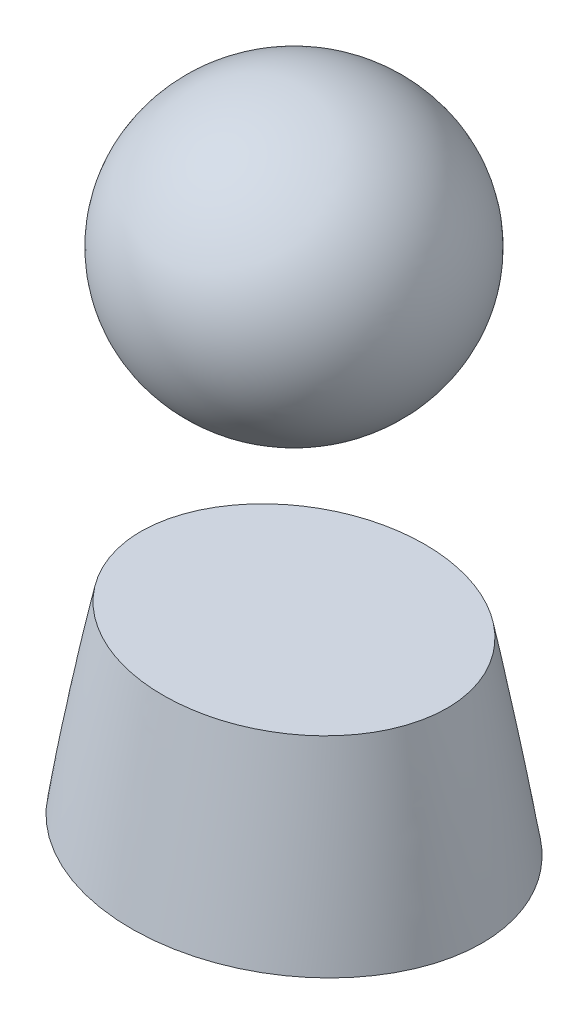
ISO-10303-21;
HEADER;
FILE_DESCRIPTION(('STEP AP214'),'2;1');
FILE_NAME('part.step','',(''),(''),'','','');
FILE_SCHEMA(('AUTOMOTIVE_DESIGN { 1 0 10303 214 1 1 1 1 }'));
ENDSEC;
DATA;
#1=APPLICATION_CONTEXT('core data for automotive mechanical design processes');
#2=APPLICATION_PROTOCOL_DEFINITION('international standard','automotive_design',2000,#1);
#3=PRODUCT_CONTEXT('',#1,'mechanical');
#4=PRODUCT('Part','Part','',(#3));
#5=PRODUCT_RELATED_PRODUCT_CATEGORY('part','',(#4));
#6=PRODUCT_DEFINITION_FORMATION('','',#4);
#7=PRODUCT_DEFINITION_CONTEXT('part definition',#1,'design');
#8=PRODUCT_DEFINITION('design','',#6,#7);
#9=PRODUCT_DEFINITION_SHAPE('','',#8);
#10=(LENGTH_UNIT() NAMED_UNIT(*) SI_UNIT(.MILLI.,.METRE.));
#11=(NAMED_UNIT(*) PLANE_ANGLE_UNIT() SI_UNIT($,.RADIAN.));
#12=(NAMED_UNIT(*) SI_UNIT($,.STERADIAN.) SOLID_ANGLE_UNIT());
#13=UNCERTAINTY_MEASURE_WITH_UNIT(LENGTH_MEASURE(1.E-05),#10,'distance_accuracy_value','');
#14=(GEOMETRIC_REPRESENTATION_CONTEXT(3) GLOBAL_UNCERTAINTY_ASSIGNED_CONTEXT((#13)) GLOBAL_UNIT_ASSIGNED_CONTEXT((#10,
#11,#12)) REPRESENTATION_CONTEXT('',''));
#15=CARTESIAN_POINT('',(0.,0.,0.));
#16=DIRECTION('',(0.,0.,1.));
#17=DIRECTION('',(1.,0.,0.));
#18=AXIS2_PLACEMENT_3D('',#15,#16,#17);
#19=CARTESIAN_POINT('',(-17.145,29.7605525885439,0.));
#20=DIRECTION('',(0.,1.,0.));
#21=DIRECTION('',(0.,0.,1.));
#22=AXIS2_PLACEMENT_3D('',#19,#20,#21);
#23=PLANE('',#22);
#24=CARTESIAN_POINT('',(-17.1450009335798,29.7605525885439,0.));
#25=CARTESIAN_POINT('',(-17.1450013778071,29.7605525885439,0.375152334039764));
#26=CARTESIAN_POINT('',(-17.1279041922706,29.7605525885439,0.750300722329052));
#27=CARTESIAN_POINT('',(-17.0603353167154,29.7605525885438,1.4977264524812));
#28=CARTESIAN_POINT('',(-17.0098485109687,29.7605525885439,1.8700024167198));
#29=CARTESIAN_POINT('',(-16.8764855934133,29.7605525885439,2.60929300532626));
#30=CARTESIAN_POINT('',(-16.7935585157081,29.7605525885439,2.97629840403801));
#31=CARTESIAN_POINT('',(-16.5966214415578,29.7605525885439,3.7017993123013));
#32=CARTESIAN_POINT('',(-16.482615844592,29.7605525885439,4.06029601854201));
#33=CARTESIAN_POINT('',(-16.2300444775407,29.7605525885439,4.7525239738148));
#34=CARTESIAN_POINT('',(-16.0926242687534,29.7605525885439,5.08667437085326));
#35=CARTESIAN_POINT('',(-15.7917188183559,29.7605525885439,5.74299843424312));
#36=CARTESIAN_POINT('',(-15.6282343116365,29.7605525885439,6.06517243795679));
#37=CARTESIAN_POINT('',(-15.2771323911803,29.7605525885439,6.69589979657489));
#38=CARTESIAN_POINT('',(-15.0895240046777,29.7605525885439,7.00445818876534));
#39=CARTESIAN_POINT('',(-14.6920653643805,29.7605525885439,7.60690943938902));
#40=CARTESIAN_POINT('',(-14.4822130172333,29.7605525885439,7.9008009137014));
#41=CARTESIAN_POINT('',(-14.0205542279075,29.7605525885439,8.5008053288898));
#42=CARTESIAN_POINT('',(-13.7666519350543,29.7605525885439,8.80530524433644));
#43=CARTESIAN_POINT('',(-13.2364217557339,29.7605525885439,9.39412630618957));
#44=CARTESIAN_POINT('',(-12.9600937663156,29.7605525885439,9.67844735994846));
#45=CARTESIAN_POINT('',(-12.5303491848176,29.7605525885439,10.0889643911015));
#46=CARTESIAN_POINT('',(-12.3845117028983,29.7605525885439,10.2231814537305));
#47=CARTESIAN_POINT('',(-12.0879888332437,29.7605525885439,10.4861500591995));
#48=CARTESIAN_POINT('',(-11.9373034683631,29.7605525885439,10.6149016277993));
#49=CARTESIAN_POINT('',(-11.4783988407301,29.7605525885439,10.9928440781801));
#50=CARTESIAN_POINT('',(-11.1633033381443,29.7605525885438,11.233749107272));
#51=CARTESIAN_POINT('',(-10.4750204974985,29.7605525885438,11.7229578669949));
#52=CARTESIAN_POINT('',(-10.0996141716325,29.7605525885439,11.9681340232837));
#53=CARTESIAN_POINT('',(-9.33125262214956,29.7605525885439,12.4292435392339));
#54=CARTESIAN_POINT('',(-8.93829593684518,29.7605525885439,12.6451744571343));
#55=CARTESIAN_POINT('',(-8.13725671460576,29.7605525885439,13.0473712643254));
#56=CARTESIAN_POINT('',(-7.72916820282187,29.7605525885439,13.2336252784755));
#57=CARTESIAN_POINT('',(-7.1077228651408,29.7605525885439,13.4902084210085));
#58=CARTESIAN_POINT('',(-6.89900561177536,29.7605525885439,13.5719419973766));
#59=CARTESIAN_POINT('',(-6.47872279030679,29.7605525885439,13.727728867033));
#60=CARTESIAN_POINT('',(-6.26715717968635,29.7605525885438,13.8017820455324));
#61=CARTESIAN_POINT('',(-5.57608128975507,29.7605525885438,14.0297748934058));
#62=CARTESIAN_POINT('',(-5.09135781295021,29.7605525885438,14.1682089663145));
#63=CARTESIAN_POINT('',(-4.11256752687502,29.7605525885439,14.4065693279633));
#64=CARTESIAN_POINT('',(-3.61849936337521,29.7605525885439,14.5064899897924));
#65=CARTESIAN_POINT('',(-2.62386910546117,29.7605525885439,14.667835915586));
#66=CARTESIAN_POINT('',(-2.12330463868679,29.7605525885439,14.7292466880579));
#67=CARTESIAN_POINT('',(-1.1191359099656,29.7605525885439,14.8132592189933));
#68=CARTESIAN_POINT('',(-0.615531825997053,29.7605525885439,14.8358632280006));
#69=CARTESIAN_POINT('',(0.97384239784154,29.7605525885439,14.844953174454));
#70=CARTESIAN_POINT('',(2.0612639311954,29.7605525885439,14.7597312498829));
#71=CARTESIAN_POINT('',(3.66888325386241,29.7605525885439,14.4979956145497));
#72=CARTESIAN_POINT('',(4.20115250299303,29.7605525885439,14.3883262976066));
#73=CARTESIAN_POINT('',(5.25465924206403,29.7605525885439,14.124209398421));
#74=CARTESIAN_POINT('',(5.77589801274377,29.7605525885438,13.9697670456862));
#75=CARTESIAN_POINT('',(6.80382962633154,29.7605525885438,13.6153238715974));
#76=CARTESIAN_POINT('',(7.31049029099118,29.7605525885439,13.4152298505924));
#77=CARTESIAN_POINT('',(8.30403091475486,29.7605525885439,12.9705764820614));
#78=CARTESIAN_POINT('',(8.79090820102972,29.7605525885439,12.7260111505253));
#79=CARTESIAN_POINT('',(9.74026369414392,29.7605525885439,12.1934781305938));
#80=CARTESIAN_POINT('',(10.2027455221579,29.7605525885439,11.905516908343));
#81=CARTESIAN_POINT('',(11.0983140153724,29.7605525885439,11.2870570889229));
#82=CARTESIAN_POINT('',(11.5314071600739,29.7605525885439,10.9565679149937));
#83=CARTESIAN_POINT('',(12.3286385749194,29.7605525885439,10.2824307936652));
#84=CARTESIAN_POINT('',(12.6955204468528,29.7605525885439,9.94202846144049));
#85=CARTESIAN_POINT('',(13.3955202871928,29.7605525885439,9.22797476001959));
#86=CARTESIAN_POINT('',(13.7286352060745,29.7605525885439,8.85432039351379));
#87=CARTESIAN_POINT('',(14.3564747928057,29.7605525885439,8.07651875331569));
#88=CARTESIAN_POINT('',(14.6512307767733,29.7605525885439,7.67239678445217));
#89=CARTESIAN_POINT('',(15.1979253421278,29.7605525885439,6.83608526097047));
#90=CARTESIAN_POINT('',(15.4498769853065,29.7605525885439,6.40390432441768));
#91=CARTESIAN_POINT('',(15.7758800953011,29.7605525885439,5.76821705926298));
#92=CARTESIAN_POINT('',(15.8695517179097,29.7605525885439,5.57459782175926));
#93=CARTESIAN_POINT('',(16.0476367654036,29.7605525885439,5.18315084618742));
#94=CARTESIAN_POINT('',(16.1320504384026,29.7605525885439,4.98532322107407));
#95=CARTESIAN_POINT('',(16.3709787051575,29.7605525885439,4.38613895166284));
#96=CARTESIAN_POINT('',(16.5112331253054,29.7605525885439,3.97897860234383));
#97=CARTESIAN_POINT('',(16.7512340412033,29.7605525885439,3.15348382322147));
#98=CARTESIAN_POINT('',(16.8510306659597,29.7605525885439,2.7351639101703));
#99=CARTESIAN_POINT('',(17.0084279699224,29.7605525885439,1.89066918213623));
#100=CARTESIAN_POINT('',(17.066037106862,29.7605525885439,1.46449595915525));
#101=CARTESIAN_POINT('',(17.132649653631,29.7605525885439,0.665619153937831));
#102=CARTESIAN_POINT('',(17.1471103337068,29.7605525885439,0.293363910471236));
#103=CARTESIAN_POINT('',(17.1423896477778,29.7605525885439,-0.45090905090994));
#104=CARTESIAN_POINT('',(17.1232118326451,29.7605525885439,-0.822926789748666));
#105=CARTESIAN_POINT('',(17.0521066540984,29.7605525885439,-1.56374945569226));
#106=CARTESIAN_POINT('',(17.0001825574533,29.7605525885439,-1.93255469955535));
#107=CARTESIAN_POINT('',(16.8646584912801,29.7605525885439,-2.66430932091683));
#108=CARTESIAN_POINT('',(16.781056588466,29.7605525885438,-3.02725833960199));
#109=CARTESIAN_POINT('',(16.5878058160912,29.7605525885438,-3.72891785497544));
#110=CARTESIAN_POINT('',(16.4794687663447,29.7605525885439,-4.06799127353928));
#111=CARTESIAN_POINT('',(16.2362291434658,29.7605525885439,-4.73647389703828));
#112=CARTESIAN_POINT('',(16.1013258966547,29.7605525885439,-5.06588285665388));
#113=CARTESIAN_POINT('',(15.8061746683433,29.7605525885439,-5.71313757420066));
#114=CARTESIAN_POINT('',(15.6459259287445,29.7605525885439,-6.03098298590949));
#115=CARTESIAN_POINT('',(15.3018427532958,29.7605525885439,-6.65364320958553));
#116=CARTESIAN_POINT('',(15.1180060312871,29.7605525885439,-6.95845675467507));
#117=CARTESIAN_POINT('',(14.7126660648001,29.7605525885439,-7.57829126593854));
#118=CARTESIAN_POINT('',(14.4893104834817,29.7605525885439,-7.89210073125778));
#119=CARTESIAN_POINT('',(14.0193746417614,29.7605525885439,-8.50179640951397));
#120=CARTESIAN_POINT('',(13.7727935097734,29.7605525885439,-8.79768194913379));
#121=CARTESIAN_POINT('',(13.2583695753719,29.7605525885439,-9.37051385275651));
#122=CARTESIAN_POINT('',(12.9905196796811,29.7605525885439,-9.64745384048063));
#123=CARTESIAN_POINT('',(12.4355108582494,29.7605525885439,-10.1812321099176));
#124=CARTESIAN_POINT('',(12.148351684513,29.7605525885439,-10.4380701333623));
#125=CARTESIAN_POINT('',(11.5183173820492,29.7605525885439,-10.9627204639952));
#126=CARTESIAN_POINT('',(11.1730411442717,29.7605525885439,-11.2276515423878));
#127=CARTESIAN_POINT('',(10.4632839292587,29.7605525885439,-11.7304235874309));
#128=CARTESIAN_POINT('',(10.0988003918368,29.7605525885439,-11.9682609292667));
#129=CARTESIAN_POINT('',(9.35314918664964,29.7605525885439,-12.416454516691));
#130=CARTESIAN_POINT('',(8.97197509318294,29.7605525885439,-12.6268000517825));
#131=CARTESIAN_POINT('',(8.1954399963707,29.7605525885439,-13.0194585395137));
#132=CARTESIAN_POINT('',(7.80007924009002,29.7605525885439,-13.2017719800484));
#133=CARTESIAN_POINT('',(7.17231606942414,29.7605525885439,-13.4646124547136));
#134=CARTESIAN_POINT('',(6.94394418193654,29.7605525885439,-13.5548852470208));
#135=CARTESIAN_POINT('',(6.48376770167296,29.7605525885439,-13.7262162355324));
#136=CARTESIAN_POINT('',(6.25196304761388,29.7605525885439,-13.8072742670068));
#137=CARTESIAN_POINT('',(5.55199528674742,29.7605525885439,-14.0366415217387));
#138=CARTESIAN_POINT('',(5.0792397357354,29.7605525885439,-14.17116003816));
#139=CARTESIAN_POINT('',(4.12472727731103,29.7605525885439,-14.4036081078253));
#140=CARTESIAN_POINT('',(3.64296738831916,29.7605525885439,-14.5015253076534));
#141=CARTESIAN_POINT('',(2.67343267209394,29.7605525885439,-14.6607180136099));
#142=CARTESIAN_POINT('',(2.18565781071901,29.7605525885439,-14.7219933116575));
#143=CARTESIAN_POINT('',(1.16308765592509,29.7605525885439,-14.8114997566861));
#144=CARTESIAN_POINT('',(0.627987007717201,29.7605525885439,-14.8362872417715));
#145=CARTESIAN_POINT('',(-0.442451928092871,29.7605525885439,-14.8414025151709));
#146=CARTESIAN_POINT('',(-0.977790229271674,29.7605525885439,-14.8217273093246));
#147=CARTESIAN_POINT('',(-2.04518101429725,29.7605525885439,-14.7385132633092));
#148=CARTESIAN_POINT('',(-2.57723263162479,29.7605525885439,-14.6749633152985));
#149=CARTESIAN_POINT('',(-3.63430336916061,29.7605525885439,-14.5043515863934));
#150=CARTESIAN_POINT('',(-4.15932242990948,29.7605525885439,-14.3972894378483));
#151=CARTESIAN_POINT('',(-5.21092165766405,29.7605525885439,-14.1365956137016));
#152=CARTESIAN_POINT('',(-5.73724804028652,29.7605525885439,-13.9819277299258));
#153=CARTESIAN_POINT('',(-6.51481523310871,29.7605525885439,-13.715505425036));
#154=CARTESIAN_POINT('',(-6.7720508555581,29.7605525885439,-13.6209462868462));
#155=CARTESIAN_POINT('',(-7.28203318259827,29.7605525885439,-13.4204150099106));
#156=CARTESIAN_POINT('',(-7.53477986511734,29.7605525885439,-13.3144428150658));
#157=CARTESIAN_POINT('',(-8.28546567697343,29.7605525885439,-12.9796488840768));
#158=CARTESIAN_POINT('',(-8.77599214159809,29.7605525885439,-12.73390135084));
#159=CARTESIAN_POINT('',(-9.73231452127438,29.7605525885439,-12.1984026327232));
#160=CARTESIAN_POINT('',(-10.1981118644749,29.7605525885439,-11.9086539927212));
#161=CARTESIAN_POINT('',(-11.0728933144021,29.7605525885439,-11.3046709199446));
#162=CARTESIAN_POINT('',(-11.4836095097904,29.7605525885439,-10.9929605949623));
#163=CARTESIAN_POINT('',(-12.0761596881795,29.7605525885439,-10.4974516923091));
#164=CARTESIAN_POINT('',(-12.2697788636796,29.7605525885439,-10.3276014354401));
#165=CARTESIAN_POINT('',(-12.6486236065961,29.7605525885439,-9.97878699755769));
#166=CARTESIAN_POINT('',(-12.8338491090979,29.7605525885439,-9.79982274608159));
#167=CARTESIAN_POINT('',(-13.375960472181,29.7605525885439,-9.24986626583086));
#168=CARTESIAN_POINT('',(-13.719559096376,29.7605525885439,-8.86557843115543));
#169=CARTESIAN_POINT('',(-14.366232300721,29.7605525885439,-8.06441655278572));
#170=CARTESIAN_POINT('',(-14.6693135700056,29.7605525885439,-7.64754790601001));
#171=CARTESIAN_POINT('',(-15.1939186242464,29.7605525885439,-6.83951807754708));
#172=CARTESIAN_POINT('',(-15.4209174994887,29.7605525885439,-6.45192610608855));
#173=CARTESIAN_POINT('',(-15.7325566869534,29.7605525885439,-5.85556663885954));
#174=CARTESIAN_POINT('',(-15.8316385761918,29.7605525885439,-5.6542552610159));
#175=CARTESIAN_POINT('',(-16.0197660418504,29.7605525885439,-5.24699750119169));
#176=CARTESIAN_POINT('',(-16.1088115454711,29.7605525885439,-5.04105108560367));
#177=CARTESIAN_POINT('',(-16.3599346150016,29.7605525885439,-4.41813471745316));
#178=CARTESIAN_POINT('',(-16.50665030308,29.7605525885439,-3.9948432627804));
#179=CARTESIAN_POINT('',(-16.7563372381106,29.7605525885439,-3.13582915545711));
#180=CARTESIAN_POINT('',(-16.8593339951368,29.7605525885438,-2.70011391095506));
#181=CARTESIAN_POINT('',(-17.0072947953413,29.7605525885438,-1.88758400331086));
#182=CARTESIAN_POINT('',(-17.0587201627951,29.7605525885438,-1.51193864491978));
#183=CARTESIAN_POINT('',(-17.1275718315784,29.7605525885439,-0.757527371864787));
#184=CARTESIAN_POINT('',(-17.1450004850786,29.7605525885439,-0.37876167491247));
#185=CARTESIAN_POINT('',(-17.1450009335798,29.7605525885439,0.));
#186=B_SPLINE_CURVE_WITH_KNOTS('',3,(#24,#25,#26,#27,#28,#29,#30,#31,#32,#33,#34,#35,#36,#37,
#38,#39,#40,#41,#42,#43,#44,#45,#46,#47,#48,#49,#50,#51,#52,#53,#54,#55,#56,#57,#58,#59,#60,#61,
#62,#63,#64,#65,#66,#67,#68,#69,#70,#71,#72,#73,#74,#75,#76,#77,#78,#79,#80,#81,#82,#83,#84,#85,
#86,#87,#88,#89,#90,#91,#92,#93,#94,#95,#96,#97,#98,#99,#100,#101,#102,#103,#104,#105,#106,#107,
#108,#109,#110,#111,#112,#113,#114,#115,#116,#117,#118,#119,#120,#121,#122,#123,#124,#125,#126,
#127,#128,#129,#130,#131,#132,#133,#134,#135,#136,#137,#138,#139,#140,#141,#142,#143,#144,#145,
#146,#147,#148,#149,#150,#151,#152,#153,#154,#155,#156,#157,#158,#159,#160,#161,#162,#163,#164,
#165,#166,#167,#168,#169,#170,#171,#172,#173,#174,#175,#176,#177,#178,#179,#180,#181,#182,#183,
#184,#185),.UNSPECIFIED.,.T.,.F.,(4,2,2,2,2,2,2,2,2,2,2,2,2,2,2,2,2,2,2,2,2,2,2,2,2,2,2,2,2,2,2,
2,2,2,2,2,2,2,2,2,2,2,2,2,2,2,2,2,2,2,2,2,2,2,2,2,2,2,2,2,2,2,2,2,2,2,2,2,2,2,2,2,2,2,2,2,2,2,2,
2,4),(0.,1.12507973806666,2.25066915701659,3.37803410257492,4.50523954099959,5.58800241600622,
6.67073476758579,7.75306312989832,8.83549343942205,10.0237198817715,11.211951779295,
11.8064334121582,12.400912242816,13.5897553684035,14.9335373332019,16.2774314247801,
17.621861929083,18.2941825077125,18.9665131331982,20.4770519907603,21.9878114584536,
23.4991390929912,25.0103790772352,28.2643142778856,29.8932545820433,31.5220047019539,
33.1541102137915,34.786435502658,36.4185178091993,38.0502391036126,39.5495119481477,
41.0489200729906,42.5470963019713,44.0448145364559,44.6898782107758,45.3349245931255,
46.6246736695412,47.9128197691052,49.2007075508191,50.3168510402486,51.4328767169106,
52.5487910764638,53.6647735508676,54.7315225406827,55.7982985851283,56.8651065435026,
57.932017975639,59.0863877946635,60.2408009510472,61.3956007422895,62.5504153678545,
63.8546778375873,65.1591145974642,66.4640580458594,67.7689787793043,68.505501058743,
69.2420365027553,70.7149821163074,72.1884244200594,73.6618750910717,75.2670449031932,
76.8723228122175,78.4780072812355,80.0837053175612,81.7271739588278,82.5491282743701,
83.3710866302681,85.0145560636816,86.6579304804542,88.2023736907398,88.9747918554214,
89.7472159927738,91.2909830132629,92.8344948529383,94.1798706570363,94.8527496019644,
95.5256334273349,96.8672057597826,98.2079942026895,99.3439769330798,100.479881064107),.UNSPECIFIED.);
#187=CARTESIAN_POINT('',(-17.1450009335798,29.7605525885439,0.));
#188=VERTEX_POINT('',#187);
#189=EDGE_CURVE('E13',#188,#188,#186,.T.);
#190=ORIENTED_EDGE('',*,*,#189,.F.);
#191=EDGE_LOOP('',(#190));
#192=FACE_BOUND('',#191,.T.);
#193=ADVANCED_FACE('F109',(#192),#23,.F.);
#194=CARTESIAN_POINT('',(-8.73125,65.0875,0.));
#195=CARTESIAN_POINT('',(-15.328017064921,45.6489549322543,0.));
#196=CARTESIAN_POINT('',(-18.8107246222282,25.2885107510739,0.));
#197=CARTESIAN_POINT('',(-19.05,4.7625,0.));
#198=CARTESIAN_POINT('',(-8.73125,65.0875,-1.14291794324027));
#199=CARTESIAN_POINT('',(-15.328017064921,45.6489549322543,-1.5931583451228));
#200=CARTESIAN_POINT('',(-18.8107246222282,25.2885107510739,-2.04339874700533));
#201=CARTESIAN_POINT('',(-19.05,4.7625,-2.49363914888786));
#202=CARTESIAN_POINT('',(-8.27717435647707,65.0875,-3.42830634321734));
#203=CARTESIAN_POINT('',(-14.4977313337537,45.6489549322543,-4.77885058683869));
#204=CARTESIAN_POINT('',(-17.7988575226424,25.2885107510739,-6.12939483046004));
#205=CARTESIAN_POINT('',(-18.0592660432166,4.7625,-7.4799390740814));
#206=CARTESIAN_POINT('',(-6.33470776698936,65.0875,-6.33493628157651));
#207=CARTESIAN_POINT('',(-11.0501306583208,45.6489549322543,-8.83050790150456));
#208=CARTESIAN_POINT('',(-13.5759804583612,25.2885107510739,-11.3260795214326));
#209=CARTESIAN_POINT('',(-13.8212920071658,4.76249999999999,-13.8216511413607));
#210=CARTESIAN_POINT('',(-3.42845769947884,65.0875,-8.27689774044255));
#211=CARTESIAN_POINT('',(-5.96301617037461,45.6489549322543,-11.5374769860811));
#212=CARTESIAN_POINT('',(-7.32980232591518,25.2885107510739,-14.7980562317196));
#213=CARTESIAN_POINT('',(-7.48030141413001,4.7625,-18.0586354773582));
#214=CARTESIAN_POINT('',(0.,65.0874999999999,-8.95888023906617));
#215=CARTESIAN_POINT('',(0.,45.6489549322542,-12.4881496493303));
#216=CARTESIAN_POINT('',(0.,25.2885107510739,-16.0174190595945));
#217=CARTESIAN_POINT('',(0.,4.76249999999999,-19.5466884698586));
#218=CARTESIAN_POINT('',(3.42845769947884,65.0875000000001,-8.27689774044256));
#219=CARTESIAN_POINT('',(5.96301617037462,45.6489549322544,-11.5374769860811));
#220=CARTESIAN_POINT('',(7.32980232591521,25.2885107510739,-14.7980562317196));
#221=CARTESIAN_POINT('',(7.48030141413002,4.7625,-18.0586354773582));
#222=CARTESIAN_POINT('',(6.33470776698938,65.0874999999999,-6.33493628157649));
#223=CARTESIAN_POINT('',(11.0501306583208,45.6489549322542,-8.83050790150453));
#224=CARTESIAN_POINT('',(13.5759804583612,25.2885107510738,-11.3260795214326));
#225=CARTESIAN_POINT('',(13.8212920071658,4.76249999999999,-13.8216511413606));
#226=CARTESIAN_POINT('',(8.27717435647706,65.0875,-3.42830634321734));
#227=CARTESIAN_POINT('',(14.4977313337537,45.6489549322543,-4.77885058683869));
#228=CARTESIAN_POINT('',(17.7988575226424,25.2885107510739,-6.12939483046005));
#229=CARTESIAN_POINT('',(18.0592660432167,4.7625,-7.4799390740814));
#230=CARTESIAN_POINT('',(8.73125,65.0875,-1.14291794324027));
#231=CARTESIAN_POINT('',(15.328017064921,45.6489549322543,-1.5931583451228));
#232=CARTESIAN_POINT('',(18.8107246222282,25.2885107510739,-2.04339874700533));
#233=CARTESIAN_POINT('',(19.05,4.7625,-2.49363914888786));
#234=CARTESIAN_POINT('',(8.73125,65.0875,1.14291794324027));
#235=CARTESIAN_POINT('',(15.328017064921,45.6489549322543,1.5931583451228));
#236=CARTESIAN_POINT('',(18.8107246222282,25.2885107510739,2.04339874700533));
#237=CARTESIAN_POINT('',(19.05,4.7625,2.49363914888786));
#238=CARTESIAN_POINT('',(8.27717435647707,65.0875,3.42830634321734));
#239=CARTESIAN_POINT('',(14.4977313337537,45.6489549322543,4.77885058683869));
#240=CARTESIAN_POINT('',(17.7988575226424,25.2885107510739,6.12939483046005));
#241=CARTESIAN_POINT('',(18.0592660432167,4.7625,7.47993907408141));
#242=CARTESIAN_POINT('',(6.33470776698937,65.0875,6.33493628157652));
#243=CARTESIAN_POINT('',(11.0501306583208,45.6489549322543,8.83050790150456));
#244=CARTESIAN_POINT('',(13.5759804583612,25.2885107510739,11.3260795214326));
#245=CARTESIAN_POINT('',(13.8212920071658,4.76249999999999,13.8216511413606));
#246=CARTESIAN_POINT('',(3.42845769947884,65.0874999999998,8.27689774044254));
#247=CARTESIAN_POINT('',(5.96301617037461,45.6489549322542,11.5374769860811));
#248=CARTESIAN_POINT('',(7.32980232591521,25.2885107510738,14.7980562317196));
#249=CARTESIAN_POINT('',(7.48030141413002,4.76249999999999,18.0586354773582));
#250=CARTESIAN_POINT('',(0.,65.0875000000001,8.95888023906618));
#251=CARTESIAN_POINT('',(0.,45.6489549322544,12.4881496493303));
#252=CARTESIAN_POINT('',(0.,25.2885107510739,16.0174190595945));
#253=CARTESIAN_POINT('',(0.,4.7625,19.5466884698586));
#254=CARTESIAN_POINT('',(-3.42845769947884,65.0874999999999,8.27689774044255));
#255=CARTESIAN_POINT('',(-5.96301617037461,45.6489549322542,11.5374769860811));
#256=CARTESIAN_POINT('',(-7.32980232591519,25.2885107510738,14.7980562317196));
#257=CARTESIAN_POINT('',(-7.48030141413002,4.76249999999999,18.0586354773581));
#258=CARTESIAN_POINT('',(-6.3347077669894,65.0875000000001,6.33493628157649));
#259=CARTESIAN_POINT('',(-11.0501306583208,45.6489549322544,8.83050790150455));
#260=CARTESIAN_POINT('',(-13.5759804583612,25.2885107510739,11.3260795214326));
#261=CARTESIAN_POINT('',(-13.8212920071658,4.7625,13.8216511413607));
#262=CARTESIAN_POINT('',(-8.27717435647704,65.0874999999999,3.42830634321734));
#263=CARTESIAN_POINT('',(-14.4977313337537,45.6489549322542,4.77885058683869));
#264=CARTESIAN_POINT('',(-17.7988575226424,25.2885107510738,6.12939483046005));
#265=CARTESIAN_POINT('',(-18.0592660432167,4.7625,7.4799390740814));
#266=CARTESIAN_POINT('',(-8.73125,65.0875,1.14291794324027));
#267=CARTESIAN_POINT('',(-15.328017064921,45.6489549322543,1.5931583451228));
#268=CARTESIAN_POINT('',(-18.8107246222282,25.2885107510739,2.04339874700533));
#269=CARTESIAN_POINT('',(-19.05,4.7625,2.49363914888786));
#270=CARTESIAN_POINT('',(-8.73125,65.0875,0.));
#271=CARTESIAN_POINT('',(-15.328017064921,45.6489549322543,0.));
#272=CARTESIAN_POINT('',(-18.8107246222282,25.2885107510739,0.));
#273=CARTESIAN_POINT('',(-19.05,4.7625,0.));
#274=B_SPLINE_SURFACE_WITH_KNOTS('',3,3,((#194,#195,#196,#197),(#198,#199,#200,#201),(#202,#203,
#204,#205),(#206,#207,#208,#209),(#210,#211,#212,#213),(#214,#215,#216,#217),(#218,#219,#220,
#221),(#222,#223,#224,#225),(#226,#227,#228,#229),(#230,#231,#232,#233),(#234,#235,#236,#237),
(#238,#239,#240,#241),(#242,#243,#244,#245),(#246,#247,#248,#249),(#250,#251,#252,#253),(#254,
#255,#256,#257),(#258,#259,#260,#261),(#262,#263,#264,#265),(#266,#267,#268,#269),(#270,#271,
#272,#273)),.UNSPECIFIED.,.T.,.F.,.F.,(4,1,1,1,1,1,1,1,2,1,1,1,1,1,1,1,4),(4,4),(0.,0.0625,
0.125,0.1875,0.25,0.3125,0.375,0.4375,0.5,0.5625,0.625,0.6875,0.75,0.8125,0.875,0.9375,1.),(0.,
1.),.UNSPECIFIED.);
#275=CARTESIAN_POINT('',(-13.9700004681955,46.7432831100692,0.));
#276=CARTESIAN_POINT('',(-13.9700001911678,46.7432831100692,-0.290817565123765));
#277=CARTESIAN_POINT('',(-13.9570290086175,46.7432831100691,-0.581639347368171));
#278=CARTESIAN_POINT('',(-13.9057701381438,46.743283110069,-1.161050952386));
#279=CARTESIAN_POINT('',(-13.8674797983195,46.743283110069,-1.44964053815799));
#280=CARTESIAN_POINT('',(-13.7664014339072,46.7432831100691,-2.02258637108888));
#281=CARTESIAN_POINT('',(-13.7036050646597,46.7432831100691,-2.3069411419543));
#282=CARTESIAN_POINT('',(-13.5545021022606,46.743283110069,-2.86941367290619));
#283=CARTESIAN_POINT('',(-13.4681939355075,46.743283110069,-3.14753101418399));
#284=CARTESIAN_POINT('',(-13.2735062082406,46.743283110069,-3.69477723745416));
#285=CARTESIAN_POINT('',(-13.1652105045478,46.743283110069,-3.9639358772733));
#286=CARTESIAN_POINT('',(-12.9869638601126,46.743283110069,-4.36047926310636));
#287=CARTESIAN_POINT('',(-12.92490984978,46.743283110069,-4.49146969818798));
#288=CARTESIAN_POINT('',(-12.7956747026588,46.743283110069,-4.75090867386899));
#289=CARTESIAN_POINT('',(-12.7284931939968,46.743283110069,-4.87935702925083));
#290=CARTESIAN_POINT('',(-12.5195915509915,46.743283110069,-5.26064214275139));
#291=CARTESIAN_POINT('',(-12.3704880349012,46.743283110069,-5.50947712733046));
#292=CARTESIAN_POINT('',(-12.0542599790541,46.7432831100691,-5.99538073676888));
#293=CARTESIAN_POINT('',(-11.8871338069959,46.7432831100691,-6.23244829301498));
#294=CARTESIAN_POINT('',(-11.5206098118922,46.7432831100691,-6.71474000775222));
#295=CARTESIAN_POINT('',(-11.3196618614253,46.7432831100691,-6.95878725444479));
#296=CARTESIAN_POINT('',(-10.8999704178435,46.743283110069,-7.43103119633703));
#297=CARTESIAN_POINT('',(-10.6812268158625,46.743283110069,-7.65922779455349));
#298=CARTESIAN_POINT('',(-10.2275192914525,46.743283110069,-8.09903887993886));
#299=CARTESIAN_POINT('',(-9.99254960133414,46.743283110069,-8.31064741308884));
#300=CARTESIAN_POINT('',(-9.50806378402802,46.743283110069,-8.71648797386099));
#301=CARTESIAN_POINT('',(-9.25854676036834,46.7432831100691,-8.91071892872556));
#302=CARTESIAN_POINT('',(-8.71032162277379,46.7432831100691,-9.30802362862449));
#303=CARTESIAN_POINT('',(-8.40966913060625,46.7432831100691,-9.50841634707489));
#304=CARTESIAN_POINT('',(-7.79410118528702,46.743283110069,-9.8859520214061));
#305=CARTESIAN_POINT('',(-7.47918424965968,46.743283110069,-10.0630925532412));
#306=CARTESIAN_POINT('',(-6.83707931679096,46.743283110069,-10.3938768809598));
#307=CARTESIAN_POINT('',(-6.50988601081298,46.743283110069,-10.5475103622791));
#308=CARTESIAN_POINT('',(-5.84529388141572,46.743283110069,-10.8307818722452));
#309=CARTESIAN_POINT('',(-5.50789518007261,46.743283110069,-10.9604201877884));
#310=CARTESIAN_POINT('',(-4.77833928245682,46.743283110069,-11.2112911614699));
#311=CARTESIAN_POINT('',(-4.38496566177611,46.743283110069,-11.3289944350394));
#312=CARTESIAN_POINT('',(-3.59019976081121,46.743283110069,-11.5333302182281));
#313=CARTESIAN_POINT('',(-3.18880621977705,46.7432831100691,-11.6199578014554));
#314=CARTESIAN_POINT('',(-2.38042901358235,46.743283110069,-11.7622105983538));
#315=CARTESIAN_POINT('',(-1.97344337056316,46.743283110069,-11.8178245377514));
#316=CARTESIAN_POINT('',(-1.15639790099236,46.7432831100691,-11.8978685208998));
#317=CARTESIAN_POINT('',(-0.74633824560746,46.7432831100691,-11.922300288148));
#318=CARTESIAN_POINT('',(-0.113016470703369,46.7432831100691,-11.9356179951637));
#319=CARTESIAN_POINT('',(0.110062210915413,46.7432831100691,-11.9356394442135));
#320=CARTESIAN_POINT('',(0.556027553394261,46.743283110069,-11.9263424720493));
#321=CARTESIAN_POINT('',(0.778914210339288,46.743283110069,-11.9170238647169));
#322=CARTESIAN_POINT('',(1.44674253891864,46.7432831100691,-11.875186702807));
#323=CARTESIAN_POINT('',(1.89088492800577,46.743283110069,-11.8287874685829));
#324=CARTESIAN_POINT('',(2.7740228777061,46.743283110069,-11.6992401381186));
#325=CARTESIAN_POINT('',(3.21301570877047,46.743283110069,-11.616073383183));
#326=CARTESIAN_POINT('',(3.86495194853398,46.743283110069,-11.4637893669926));
#327=CARTESIAN_POINT('',(4.08118445033734,46.743283110069,-11.4084349610578));
#328=CARTESIAN_POINT('',(4.51109089058107,46.7432831100691,-11.2885065895627));
#329=CARTESIAN_POINT('',(4.72476484632064,46.7432831100691,-11.2239326863767));
#330=CARTESIAN_POINT('',(5.15052125214876,46.7432831100691,-11.085039507716));
#331=CARTESIAN_POINT('',(5.36258325408878,46.7432831100691,-11.01065745269));
#332=CARTESIAN_POINT('',(5.78316189810742,46.743283110069,-10.8525077481503));
#333=CARTESIAN_POINT('',(5.99167851449229,46.743283110069,-10.7687400306513));
#334=CARTESIAN_POINT('',(6.6113410194489,46.743283110069,-10.5035065617124));
#335=CARTESIAN_POINT('',(7.01663486004699,46.743283110069,-10.308098997287));
#336=CARTESIAN_POINT('',(7.8070961663412,46.743283110069,-9.88115895368144));
#337=CARTESIAN_POINT('',(8.19228544293632,46.7432831100691,-9.64966675684896));
#338=CARTESIAN_POINT('',(8.93880083834937,46.743283110069,-9.15101685412034));
#339=CARTESIAN_POINT('',(9.30013579116549,46.743283110069,-8.88387246334455));
#340=CARTESIAN_POINT('',(9.91394835363443,46.743283110069,-8.38013925245385));
#341=CARTESIAN_POINT('',(10.1723189051166,46.743283110069,-8.1507022002378));
#342=CARTESIAN_POINT('',(10.6698578935435,46.7432831100691,-7.67186491520451));
#343=CARTESIAN_POINT('',(10.909028133788,46.7432831100691,-7.42246656156331));
#344=CARTESIAN_POINT('',(11.3659796478203,46.743283110069,-6.90483393395048));
#345=CARTESIAN_POINT('',(11.5837643255018,46.743283110069,-6.63660266926655));
#346=CARTESIAN_POINT('',(11.9956023997085,46.7432831100691,-6.08245890118284));
#347=CARTESIAN_POINT('',(12.1896557290785,46.7432831100691,-5.79654634775175));
#348=CARTESIAN_POINT('',(12.5527459729484,46.7432831100691,-5.20635565953905));
#349=CARTESIAN_POINT('',(12.7215928841755,46.7432831100691,-4.90196020376724));
#350=CARTESIAN_POINT('',(13.0297117853257,46.743283110069,-4.27850561914596));
#351=CARTESIAN_POINT('',(13.168983485052,46.743283110069,-3.95944634645005));
#352=CARTESIAN_POINT('',(13.4157951945904,46.7432831100691,-3.30960240013579));
#353=CARTESIAN_POINT('',(13.5233649430766,46.7432831100691,-2.9788290436106));
#354=CARTESIAN_POINT('',(13.7050719785238,46.743283110069,-2.30822529395654));
#355=CARTESIAN_POINT('',(13.7792128085727,46.743283110069,-1.96839586471458));
#356=CARTESIAN_POINT('',(13.885262728024,46.743283110069,-1.32610378681848));
#357=CARTESIAN_POINT('',(13.9213157539786,46.743283110069,-1.02432763984676));
#358=CARTESIAN_POINT('',(13.954610671364,46.743283110069,-0.570236963025791));
#359=CARTESIAN_POINT('',(13.9622447865944,46.743283110069,-0.418630860581491));
#360=CARTESIAN_POINT('',(13.9704904464352,46.743283110069,-0.115225922616556));
#361=CARTESIAN_POINT('',(13.9711018926624,46.743283110069,0.0365729155743927));
#362=CARTESIAN_POINT('',(13.9623745641172,46.743283110069,0.491590981046394));
#363=CARTESIAN_POINT('',(13.9424916117429,46.7432831100691,0.79466961550446));
#364=CARTESIAN_POINT('',(13.8753839317936,46.743283110069,1.39787350254658));
#365=CARTESIAN_POINT('',(13.8281456628125,46.743283110069,1.69799721750398));
#366=CARTESIAN_POINT('',(13.7118830954677,46.743283110069,2.27042562286972));
#367=CARTESIAN_POINT('',(13.6447712176245,46.743283110069,2.54312089396454));
#368=CARTESIAN_POINT('',(13.4889367321261,46.7432831100691,3.08226790365596));
#369=CARTESIAN_POINT('',(13.4002130994067,46.743283110069,3.34871934544501));
#370=CARTESIAN_POINT('',(13.2021556551037,46.743283110069,3.87385516607717));
#371=CARTESIAN_POINT('',(13.092820720217,46.743283110069,4.1325391207059));
#372=CARTESIAN_POINT('',(12.8545454008194,46.7432831100691,4.64072082072147));
#373=CARTESIAN_POINT('',(12.7256033676286,46.7432831100691,4.89021779141941));
#374=CARTESIAN_POINT('',(12.4398684748872,46.7432831100691,5.39607204750604));
#375=CARTESIAN_POINT('',(12.2817567318221,46.743283110069,5.65168374111362));
#376=CARTESIAN_POINT('',(11.9465126673257,46.743283110069,6.15012276655927));
#377=CARTESIAN_POINT('',(11.769378093112,46.743283110069,6.39294857914106));
#378=CARTESIAN_POINT('',(11.3977424879261,46.743283110069,6.86490913384069));
#379=CARTESIAN_POINT('',(11.2032413165506,46.743283110069,7.09404376524474));
#380=CARTESIAN_POINT('',(10.7983224217794,46.7432831100691,7.53796961006559));
#381=CARTESIAN_POINT('',(10.5878967805408,46.7432831100691,7.75275358689637));
#382=CARTESIAN_POINT('',(10.1233359884571,46.7432831100691,8.19500373194685));
#383=CARTESIAN_POINT('',(9.86712717272373,46.7432831100691,8.42029502012634));
#384=CARTESIAN_POINT('',(9.33811196466489,46.743283110069,8.85064791082936));
#385=CARTESIAN_POINT('',(9.06529844926272,46.743283110069,9.05570073116315));
#386=CARTESIAN_POINT('',(8.50517124674605,46.743283110069,9.44542554229558));
#387=CARTESIAN_POINT('',(8.21784580154761,46.7432831100691,9.63008060717766));
#388=CARTESIAN_POINT('',(7.63094310819855,46.743283110069,9.97849082214723));
#389=CARTESIAN_POINT('',(7.33136942985099,46.743283110069,10.1422520053172));
#390=CARTESIAN_POINT('',(6.67930862504611,46.743283110069,10.4699428891846));
#391=CARTESIAN_POINT('',(6.32524282912837,46.743283110069,10.6307495961907));
#392=CARTESIAN_POINT('',(5.78590821900805,46.743283110069,10.85097124235));
#393=CARTESIAN_POINT('',(5.6048387783052,46.743283110069,10.9208542699936));
#394=CARTESIAN_POINT('',(5.24013594971236,46.743283110069,11.0535998635746));
#395=CARTESIAN_POINT('',(5.05650247385677,46.743283110069,11.1164621879803));
#396=CARTESIAN_POINT('',(4.50197339124454,46.743283110069,11.2946229822955));
#397=CARTESIAN_POINT('',(4.12764704097523,46.743283110069,11.3994147084856));
#398=CARTESIAN_POINT('',(3.3722260342222,46.7432831100691,11.5811794134043));
#399=CARTESIAN_POINT('',(2.99112884891071,46.7432831100691,11.6581417588679));
#400=CARTESIAN_POINT('',(2.18145660498807,46.7432831100691,11.7912912886329));
#401=CARTESIAN_POINT('',(1.75233373491759,46.7432831100691,11.8441970728599));
#402=CARTESIAN_POINT('',(0.891414839719358,46.743283110069,11.9154030204117));
#403=CARTESIAN_POINT('',(0.459619038832971,46.743283110069,11.9337060482418));
#404=CARTESIAN_POINT('',(-0.836346616006395,46.7432831100691,11.9359193764018));
#405=CARTESIAN_POINT('',(-1.70142950848086,46.7432831100691,11.8671890749217));
#406=CARTESIAN_POINT('',(-3.00117198833144,46.7432831100691,11.6579437037891));
#407=CARTESIAN_POINT('',(-3.44464564484856,46.743283110069,11.5671918973906));
#408=CARTESIAN_POINT('',(-4.32233712302014,46.743283110069,11.3479016209259));
#409=CARTESIAN_POINT('',(-4.75655536783849,46.743283110069,11.2193648824048));
#410=CARTESIAN_POINT('',(-5.61194181600918,46.743283110069,10.9240354439796));
#411=CARTESIAN_POINT('',(-6.03310529513549,46.7432831100691,10.7572290744555));
#412=CARTESIAN_POINT('',(-6.8586394259711,46.743283110069,10.3861348167326));
#413=CARTESIAN_POINT('',(-7.2630096523197,46.743283110069,10.1818459798398));
#414=CARTESIAN_POINT('',(-8.03412125172039,46.743283110069,9.74605269586753));
#415=CARTESIAN_POINT('',(-8.40173248789522,46.743283110069,9.51608863782066));
#416=CARTESIAN_POINT('',(-9.1140623873287,46.743283110069,9.0229828917723));
#417=CARTESIAN_POINT('',(-9.45878199336877,46.743283110069,8.75984257141551));
#418=CARTESIAN_POINT('',(-10.1202460425969,46.743283110069,8.20135219501783));
#419=CARTESIAN_POINT('',(-10.4370310623988,46.7432831100691,7.90605029820242));
#420=CARTESIAN_POINT('',(-11.0390183835943,46.743283110069,7.28485807706933));
#421=CARTESIAN_POINT('',(-11.3242296457066,46.743283110069,6.95897648011485));
#422=CARTESIAN_POINT('',(-11.7857112633222,46.743283110069,6.37167192237664));
#423=CARTESIAN_POINT('',(-11.9704870548561,46.743283110069,6.11688818376508));
#424=CARTESIAN_POINT('',(-12.3190707954934,46.7432831100691,5.59333330427299));
#425=CARTESIAN_POINT('',(-12.4828834942145,46.743283110069,5.32456535128259));
#426=CARTESIAN_POINT('',(-12.7112572804639,46.743283110069,4.9120195421078));
#427=CARTESIAN_POINT('',(-12.7844741277064,46.743283110069,4.77297619146657));
#428=CARTESIAN_POINT('',(-12.9248940891609,46.743283110069,4.49188633983729));
#429=CARTESIAN_POINT('',(-12.9920972033403,46.743283110069,4.34983983883294));
#430=CARTESIAN_POINT('',(-13.1843771165076,46.743283110069,3.91954169166427));
#431=CARTESIAN_POINT('',(-13.3001635579315,46.743283110069,3.62706101156245));
#432=CARTESIAN_POINT('',(-13.4951709210954,46.743283110069,3.06270110297458));
#433=CARTESIAN_POINT('',(-13.5768874167759,46.743283110069,2.79167776963858));
#434=CARTESIAN_POINT('',(-13.7180210776361,46.7432831100691,2.24387066051791));
#435=CARTESIAN_POINT('',(-13.7774394889426,46.7432831100691,1.96708720754979));
#436=CARTESIAN_POINT('',(-13.8730602774233,46.743283110069,1.40961810725712));
#437=CARTESIAN_POINT('',(-13.9092698847781,46.743283110069,1.12893370305282));
#438=CARTESIAN_POINT('',(-13.9577395633253,46.7432831100691,0.565500797607857));
#439=CARTESIAN_POINT('',(-13.9700007375405,46.7432831100692,0.28275239203357));
#440=CARTESIAN_POINT('',(-13.9700004681955,46.7432831100692,0.));
#441=B_SPLINE_CURVE_WITH_KNOTS('',3,(#275,#276,#277,#278,#279,#280,#281,#282,#283,#284,#285,
#286,#287,#288,#289,#290,#291,#292,#293,#294,#295,#296,#297,#298,#299,#300,#301,#302,#303,#304,
#305,#306,#307,#308,#309,#310,#311,#312,#313,#314,#315,#316,#317,#318,#319,#320,#321,#322,#323,
#324,#325,#326,#327,#328,#329,#330,#331,#332,#333,#334,#335,#336,#337,#338,#339,#340,#341,#342,
#343,#344,#345,#346,#347,#348,#349,#350,#351,#352,#353,#354,#355,#356,#357,#358,#359,#360,#361,
#362,#363,#364,#365,#366,#367,#368,#369,#370,#371,#372,#373,#374,#375,#376,#377,#378,#379,#380,
#381,#382,#383,#384,#385,#386,#387,#388,#389,#390,#391,#392,#393,#394,#395,#396,#397,#398,#399,
#400,#401,#402,#403,#404,#405,#406,#407,#408,#409,#410,#411,#412,#413,#414,#415,#416,#417,#418,
#419,#420,#421,#422,#423,#424,#425,#426,#427,#428,#429,#430,#431,#432,#433,#434,#435,#436,#437,
#438,#439,#440),.UNSPECIFIED.,.T.,.F.,(4,2,2,2,2,2,2,2,2,2,2,2,2,2,2,2,2,2,2,2,2,2,2,2,2,2,2,2,
2,2,2,2,2,2,2,2,2,2,2,2,2,2,2,2,2,2,2,2,2,2,2,2,2,2,2,2,2,2,2,2,2,2,2,2,2,2,2,2,2,2,2,2,2,2,2,2,
2,2,2,2,2,2,4),(0.,0.872184529475073,1.74446042508263,2.61703360285721,3.48966519471167,
4.35902920466306,4.793768559668,5.22853947430647,6.09789033172692,6.96731999197202,
7.91476511064697,8.86221602581518,9.81000547075893,10.7578533845975,11.8407089209607,
12.9236772557554,14.0071194274958,15.0905486443059,16.3210368177804,17.5517199729463,
18.7828502225821,20.0139124223843,20.6829733424936,21.3520475951801,22.6900993084317,
24.0288308338933,24.6982757550571,25.3677161473187,26.0416707689091,26.7156302726323,
28.0634383118131,29.4097523880589,30.7555650525756,31.7911478613163,32.8266332937097,
33.8619536420693,34.8972769201261,35.9400480241524,36.9828293595482,38.0246293556475,
39.0663189067407,39.9767645519898,40.4320160725939,40.887273970985,41.7970770772474,
42.7073309389364,43.5489139796332,44.3905369451159,45.23220579179,46.0739454500879,
46.9747051026884,47.8755715458021,48.7764452727905,49.677769906059,50.7002254928412,
51.7231228265307,52.7468626764523,53.7703062505285,54.9356105187924,55.5177509956087,
56.0999114935169,57.2648718462876,58.4302768469454,59.7258748925671,61.0213656805499,
63.611340687273,64.9680897930112,66.3247767335964,67.6819490289602,69.0391556795577,
70.3382333153718,71.6372574160382,72.9343624092717,74.231098331694,75.1744112038733,
76.117509969377,76.5888130633173,77.0601161598158,78.0024816326552,78.8508289540257,
79.6991288585056,80.5471643656322,81.3951608128165),.UNSPECIFIED.);
#442=CARTESIAN_POINT('',(-13.9700004681956,46.7432831100691,0.));
#443=VERTEX_POINT('',#442);
#444=EDGE_CURVE('E113',#443,#443,#441,.T.);
#445=CARTESIAN_POINT('',(-13.9700004681956,46.7432831100691,0.));
#446=CARTESIAN_POINT('',(-14.0109122235124,46.5679087994912,0.));
#447=CARTESIAN_POINT('',(-14.0515807705908,46.3924777527015,0.));
#448=CARTESIAN_POINT('',(-14.1324295697777,46.0415103520288,0.));
#449=CARTESIAN_POINT('',(-14.1726098407871,45.8659740024999,0.));
#450=CARTESIAN_POINT('',(-14.2524819118699,45.5147970259286,0.));
#451=CARTESIAN_POINT('',(-14.2921737299297,45.3391564029772,0.));
#452=CARTESIAN_POINT('',(-14.3710687201409,44.9877719093616,0.));
#453=CARTESIAN_POINT('',(-14.4102719093639,44.8120280425304,0.));
#454=CARTESIAN_POINT('',(-14.4881894666633,44.4604380908899,0.));
#455=CARTESIAN_POINT('',(-14.5269038508961,44.2845920096612,0.));
#456=CARTESIAN_POINT('',(-14.6038436230485,43.9327986589712,0.));
#457=CARTESIAN_POINT('',(-14.6420690262089,43.7568513928432,0.));
#458=CARTESIAN_POINT('',(-14.7180306610314,43.4048567020906,0.));
#459=CARTESIAN_POINT('',(-14.7557669070182,43.2288092805574,0.));
#460=CARTESIAN_POINT('',(-14.8307500523137,42.8766153087263,0.));
#461=CARTESIAN_POINT('',(-14.8679969650307,42.700468761283,0.));
#462=CARTESIAN_POINT('',(-14.942001268606,42.348077567358,0.));
#463=CARTESIAN_POINT('',(-14.9787586719556,42.1718329234995,0.));
#464=CARTESIAN_POINT('',(-15.0517837816164,41.8192465664651,0.));
#465=CARTESIAN_POINT('',(-15.0880514995014,41.6429048556863,0.));
#466=CARTESIAN_POINT('',(-15.1600970630534,41.2901253945271,0.));
#467=CARTESIAN_POINT('',(-15.1958749193763,41.1136876463228,0.));
#468=CARTESIAN_POINT('',(-15.2669405846255,40.7607171400232,0.));
#469=CARTESIAN_POINT('',(-15.302228403289,40.5841843838884,0.));
#470=CARTESIAN_POINT('',(-15.372313818041,40.231024891433,0.));
#471=CARTESIAN_POINT('',(-15.4071114229477,40.0543981568624,0.));
#472=CARTESIAN_POINT('',(-15.4762162350082,39.7010517372356,0.));
#473=CARTESIAN_POINT('',(-15.5105234500605,39.5243320537242,0.));
#474=CARTESIAN_POINT('',(-15.5786473072352,39.1708007659105,0.));
#475=CARTESIAN_POINT('',(-15.6124639563357,38.993989162953,0.));
#476=CARTESIAN_POINT('',(-15.6796065064303,38.640275065937,0.));
#477=CARTESIAN_POINT('',(-15.7129324134814,38.4633725730283,0.));
#478=CARTESIAN_POINT('',(-15.7790933043014,38.1094777257943,0.));
#479=CARTESIAN_POINT('',(-15.8119282932055,37.9324853724291,0.));
#480=CARTESIAN_POINT('',(-15.8771071725564,37.5784118339617,0.));
#481=CARTESIAN_POINT('',(-15.909451067216,37.401330649635,0.));
#482=CARTESIAN_POINT('',(-15.9736475829034,37.0470804789185,0.));
#483=CARTESIAN_POINT('',(-16.0055002072208,36.8699114931249,0.));
#484=CARTESIAN_POINT('',(-16.06871400705,36.5154867491438,0.));
#485=CARTESIAN_POINT('',(-16.1000751849275,36.3382309913782,0.));
#486=CARTESIAN_POINT('',(-16.162305916704,35.9836337331169,0.));
#487=CARTESIAN_POINT('',(-16.1931754720439,35.8062922328741,0.));
#488=CARTESIAN_POINT('',(-16.2544227835731,35.4515245193171,0.));
#489=CARTESIAN_POINT('',(-16.2848005402776,35.2740983060918,0.));
#490=CARTESIAN_POINT('',(-16.3450640793647,34.9191621962234,0.));
#491=CARTESIAN_POINT('',(-16.3749498613362,34.7416522995104,0.));
#492=CARTESIAN_POINT('',(-16.4342292757866,34.386549852315,0.));
#493=CARTESIAN_POINT('',(-16.463622906927,34.2089573016091,0.));
#494=CARTESIAN_POINT('',(-16.5219178445459,33.8536905760711,0.));
#495=CARTESIAN_POINT('',(-16.5508191487575,33.6760164008671,0.));
#496=CARTESIAN_POINT('',(-16.6081292573502,33.320587455971,0.));
#497=CARTESIAN_POINT('',(-16.6365380585353,33.1428326857635,0.));
#498=CARTESIAN_POINT('',(-16.6928629859062,32.7872435804935,0.));
#499=CARTESIAN_POINT('',(-16.7207791079658,32.6094092447773,0.));
#500=CARTESIAN_POINT('',(-16.776118501923,32.2536620381182,0.));
#501=CARTESIAN_POINT('',(-16.8035417687632,32.0757491663885,0.));
#502=CARTESIAN_POINT('',(-16.8578952771007,31.719845917323,0.));
#503=CARTESIAN_POINT('',(-16.8848255126083,31.5418555390725,0.));
#504=CARTESIAN_POINT('',(-16.9381927831725,31.185798306591,0.));
#505=CARTESIAN_POINT('',(-16.964629811306,31.0077314513225,0.));
#506=CARTESIAN_POINT('',(-17.0170104917473,30.651522294387,0.));
#507=CARTESIAN_POINT('',(-17.0429541361976,30.4733799915646,0.));
#508=CARTESIAN_POINT('',(-17.0943478748979,30.1170209692434,0.));
#509=CARTESIAN_POINT('',(-17.1197979603549,29.9388042484765,0.));
#510=CARTESIAN_POINT('',(-17.1450009335798,29.7605525885439,0.));
#511=B_SPLINE_CURVE_WITH_KNOTS('',3,(#445,#446,#447,#448,#449,#450,#451,#452,#453,#454,#455,
#456,#457,#458,#459,#460,#461,#462,#463,#464,#465,#466,#467,#468,#469,#470,#471,#472,#473,#474,
#475,#476,#477,#478,#479,#480,#481,#482,#483,#484,#485,#486,#487,#488,#489,#490,#491,#492,#493,
#494,#495,#496,#497,#498,#499,#500,#501,#502,#503,#504,#505,#506,#507,#508,#509,#510),
.UNSPECIFIED.,.F.,.F.,(4,2,2,2,2,2,2,2,2,2,2,2,2,2,2,2,2,2,2,2,2,2,2,2,2,2,2,2,2,2,2,2,4),(0.,
0.540249107059305,1.08047723420324,1.62068540840837,2.16087465569877,2.70104600119459,
3.24120046916052,3.78133908305451,4.32146286557635,4.86157283871621,5.40167002380345,
5.94175544155517,6.48183011212498,7.02189505515165,7.56195128980792,8.10199983484913,
8.64204170866202,9.18207792931354,9.7221095145995,10.2621374820935,10.8021628491954,
11.3421866331808,11.8822098512488,12.4222335205716,12.9622586583433,13.502286281828,
14.0423174084093,14.5823530556386,15.1223942412845,15.6624419833808,16.2024973002757,
16.7425612106806,17.2826347337187),.UNSPECIFIED.);
#512=EDGE_CURVE('BSEAM129',#443,#188,#511,.T.);
#513=ORIENTED_EDGE('',*,*,#444,.T.);
#514=ORIENTED_EDGE('',*,*,#189,.T.);
#515=ORIENTED_EDGE('',*,*,#512,.T.);
#516=ORIENTED_EDGE('',*,*,#512,.F.);
#517=EDGE_LOOP('',(#513,#515,#514,#516));
#518=FACE_BOUND('',#517,.T.);
#519=ADVANCED_FACE('F129',(#518),#274,.T.);
#520=CARTESIAN_POINT('',(-29.845,46.743283110069,0.));
#521=DIRECTION('',(0.,-1.,0.));
#522=DIRECTION('',(0.,0.,-1.));
#523=AXIS2_PLACEMENT_3D('',#520,#521,#522);
#524=PLANE('',#523);
#525=ORIENTED_EDGE('',*,*,#444,.F.);
#526=EDGE_LOOP('',(#525));
#527=FACE_BOUND('',#526,.T.);
#528=ADVANCED_FACE('F134',(#527),#524,.F.);
#529=CLOSED_SHELL('',(#193,#519,#528));
#530=MANIFOLD_SOLID_BREP('B2',#529);
#531=CARTESIAN_POINT('',(0.,76.2,0.));
#532=DIRECTION('',(0.,0.,1.));
#533=DIRECTION('',(-1.,0.,0.));
#534=AXIS2_PLACEMENT_3D('',#531,#532,#533);
#535=ELLIPSE('',#534,13.49375,12.7);
#536=TRIMMED_CURVE('',#535,(PARAMETER_VALUE(4.71238898038469)),
(PARAMETER_VALUE(7.85398163397448)),.T.,.PARAMETER.);
#537=CARTESIAN_POINT('',(0.,65.0875,0.));
#538=DIRECTION('',(0.,-1.,0.));
#539=AXIS1_PLACEMENT('',#537,#538);
#540=SURFACE_OF_REVOLUTION('',#536,#539);
#541=CARTESIAN_POINT('',(0.,63.5,0.));
#542=VERTEX_POINT('',#541);
#543=VERTEX_LOOP('',#542);
#544=FACE_BOUND('',#543,.T.);
#545=CARTESIAN_POINT('',(0.,88.9,0.));
#546=VERTEX_POINT('',#545);
#547=VERTEX_LOOP('',#546);
#548=FACE_BOUND('',#547,.T.);
#549=ADVANCED_FACE('F172',(#544,#548),#540,.T.);
#550=CLOSED_SHELL('',(#549));
#551=MANIFOLD_SOLID_BREP('B8_NOT_SHOWN',#550);
#552=ADVANCED_BREP_SHAPE_REPRESENTATION('',(#18,#530,#551),#14);
#553=SHAPE_DEFINITION_REPRESENTATION(#9,#552);
ENDSEC;
END-ISO-10303-21;
